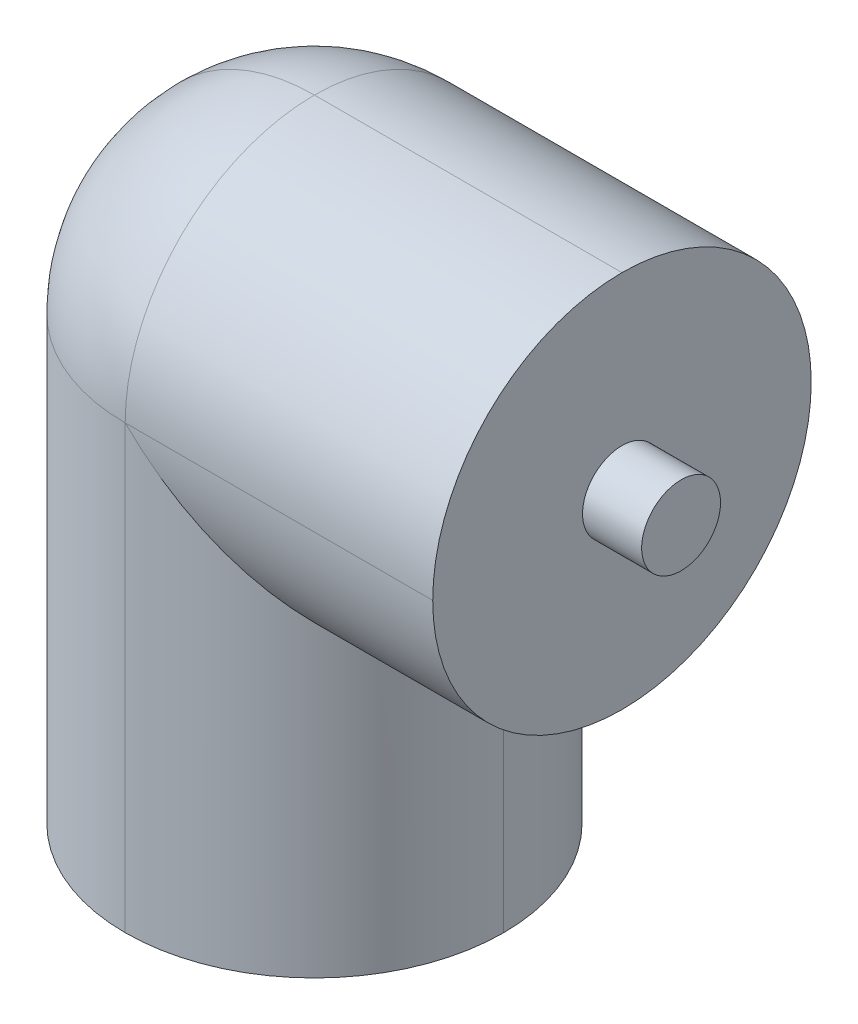
ISO-10303-21;
HEADER;
FILE_DESCRIPTION(('STEP AP214'),'2;1');
FILE_NAME('part.step','',(''),(''),'','','');
FILE_SCHEMA(('AUTOMOTIVE_DESIGN { 1 0 10303 214 1 1 1 1 }'));
ENDSEC;
DATA;
#1=APPLICATION_CONTEXT('core data for automotive mechanical design processes');
#2=APPLICATION_PROTOCOL_DEFINITION('international standard','automotive_design',2000,#1);
#3=PRODUCT_CONTEXT('',#1,'mechanical');
#4=PRODUCT('Part','Part','',(#3));
#5=PRODUCT_RELATED_PRODUCT_CATEGORY('part','',(#4));
#6=PRODUCT_DEFINITION_FORMATION('','',#4);
#7=PRODUCT_DEFINITION_CONTEXT('part definition',#1,'design');
#8=PRODUCT_DEFINITION('design','',#6,#7);
#9=PRODUCT_DEFINITION_SHAPE('','',#8);
#10=(LENGTH_UNIT() NAMED_UNIT(*) SI_UNIT(.MILLI.,.METRE.));
#11=(NAMED_UNIT(*) PLANE_ANGLE_UNIT() SI_UNIT($,.RADIAN.));
#12=(NAMED_UNIT(*) SI_UNIT($,.STERADIAN.) SOLID_ANGLE_UNIT());
#13=UNCERTAINTY_MEASURE_WITH_UNIT(LENGTH_MEASURE(1.E-05),#10,'distance_accuracy_value','');
#14=(GEOMETRIC_REPRESENTATION_CONTEXT(3) GLOBAL_UNCERTAINTY_ASSIGNED_CONTEXT((#13)) GLOBAL_UNIT_ASSIGNED_CONTEXT((#10,
#11,#12)) REPRESENTATION_CONTEXT('',''));
#15=CARTESIAN_POINT('',(0.,0.,0.));
#16=DIRECTION('',(0.,0.,1.));
#17=DIRECTION('',(1.,0.,0.));
#18=AXIS2_PLACEMENT_3D('',#15,#16,#17);
#19=CARTESIAN_POINT('',(0.,0.,0.));
#20=DIRECTION('',(0.,-1.,0.));
#21=DIRECTION('',(0.,0.,-1.));
#22=AXIS2_PLACEMENT_3D('',#19,#20,#21);
#23=PLANE('',#22);
#24=CARTESIAN_POINT('',(24.,0.,-24.));
#25=DIRECTION('',(0.,-1.,0.));
#26=DIRECTION('',(0.,0.,-1.));
#27=AXIS2_PLACEMENT_3D('',#24,#25,#26);
#28=CIRCLE('',#27,5.);
#29=CARTESIAN_POINT('',(24.,0.,-29.));
#30=VERTEX_POINT('',#29);
#31=EDGE_CURVE('E136',#30,#30,#28,.F.);
#32=ORIENTED_EDGE('',*,*,#31,.T.);
#33=EDGE_LOOP('',(#32));
#34=FACE_BOUND('',#33,.T.);
#35=CARTESIAN_POINT('',(24.,0.,-24.));
#36=DIRECTION('',(0.,-1.,0.));
#37=DIRECTION('',(0.,0.,-1.));
#38=AXIS2_PLACEMENT_3D('',#35,#36,#37);
#39=CIRCLE('',#38,24.);
#40=CARTESIAN_POINT('',(0.,0.,-24.));
#41=VERTEX_POINT('',#40);
#42=CARTESIAN_POINT('',(24.,0.,-48.));
#43=VERTEX_POINT('',#42);
#44=EDGE_CURVE('E47',#41,#43,#39,.T.);
#45=ORIENTED_EDGE('',*,*,#44,.T.);
#46=CARTESIAN_POINT('',(24.,0.,-24.));
#47=DIRECTION('',(0.,-1.,0.));
#48=DIRECTION('',(0.,0.,-1.));
#49=AXIS2_PLACEMENT_3D('',#46,#47,#48);
#50=CIRCLE('',#49,24.);
#51=CARTESIAN_POINT('',(48.,0.,-24.));
#52=VERTEX_POINT('',#51);
#53=EDGE_CURVE('E11',#43,#52,#50,.T.);
#54=ORIENTED_EDGE('',*,*,#53,.T.);
#55=CARTESIAN_POINT('',(24.,0.,-24.));
#56=DIRECTION('',(0.,-1.,0.));
#57=DIRECTION('',(0.,0.,-1.));
#58=AXIS2_PLACEMENT_3D('',#55,#56,#57);
#59=CIRCLE('',#58,24.);
#60=CARTESIAN_POINT('',(24.,0.,0.));
#61=VERTEX_POINT('',#60);
#62=EDGE_CURVE('E55',#52,#61,#59,.T.);
#63=ORIENTED_EDGE('',*,*,#62,.T.);
#64=CARTESIAN_POINT('',(24.,0.,-24.));
#65=DIRECTION('',(0.,-1.,0.));
#66=DIRECTION('',(0.,0.,-1.));
#67=AXIS2_PLACEMENT_3D('',#64,#65,#66);
#68=CIRCLE('',#67,24.);
#69=EDGE_CURVE('E102',#61,#41,#68,.T.);
#70=ORIENTED_EDGE('',*,*,#69,.T.);
#71=EDGE_LOOP('',(#45,#54,#63,#70));
#72=FACE_BOUND('',#71,.T.);
#73=ADVANCED_FACE('F37',(#34,#72),#23,.T.);
#74=CARTESIAN_POINT('',(63.,0.,0.));
#75=DIRECTION('',(1.,0.,0.));
#76=DIRECTION('',(0.,0.,-1.));
#77=AXIS2_PLACEMENT_3D('',#74,#75,#76);
#78=PLANE('',#77);
#79=CARTESIAN_POINT('',(63.,56.,-24.));
#80=DIRECTION('',(1.,0.,0.));
#81=DIRECTION('',(0.,0.,-1.));
#82=AXIS2_PLACEMENT_3D('',#79,#80,#81);
#83=CIRCLE('',#82,5.);
#84=CARTESIAN_POINT('',(63.,56.,-29.));
#85=VERTEX_POINT('',#84);
#86=EDGE_CURVE('E41',#85,#85,#83,.F.);
#87=ORIENTED_EDGE('',*,*,#86,.T.);
#88=EDGE_LOOP('',(#87));
#89=FACE_BOUND('',#88,.T.);
#90=CARTESIAN_POINT('',(63.,56.,-24.));
#91=DIRECTION('',(1.,0.,0.));
#92=DIRECTION('',(0.,0.,-1.));
#93=AXIS2_PLACEMENT_3D('',#90,#91,#92);
#94=CIRCLE('',#93,24.);
#95=CARTESIAN_POINT('',(63.,32.,-24.));
#96=VERTEX_POINT('',#95);
#97=CARTESIAN_POINT('',(63.,56.,-48.));
#98=VERTEX_POINT('',#97);
#99=EDGE_CURVE('E135',#96,#98,#94,.T.);
#100=ORIENTED_EDGE('',*,*,#99,.T.);
#101=CARTESIAN_POINT('',(63.,56.,-24.));
#102=DIRECTION('',(1.,0.,0.));
#103=DIRECTION('',(0.,0.,-1.));
#104=AXIS2_PLACEMENT_3D('',#101,#102,#103);
#105=CIRCLE('',#104,24.);
#106=CARTESIAN_POINT('',(63.,80.,-24.));
#107=VERTEX_POINT('',#106);
#108=EDGE_CURVE('E157',#98,#107,#105,.T.);
#109=ORIENTED_EDGE('',*,*,#108,.T.);
#110=CARTESIAN_POINT('',(63.,56.,-24.));
#111=DIRECTION('',(1.,0.,0.));
#112=DIRECTION('',(0.,0.,-1.));
#113=AXIS2_PLACEMENT_3D('',#110,#111,#112);
#114=CIRCLE('',#113,24.);
#115=CARTESIAN_POINT('',(63.,56.,0.));
#116=VERTEX_POINT('',#115);
#117=EDGE_CURVE('E88',#107,#116,#114,.T.);
#118=ORIENTED_EDGE('',*,*,#117,.T.);
#119=CARTESIAN_POINT('',(63.,56.,-24.));
#120=DIRECTION('',(1.,0.,0.));
#121=DIRECTION('',(0.,0.,-1.));
#122=AXIS2_PLACEMENT_3D('',#119,#120,#121);
#123=CIRCLE('',#122,24.);
#124=EDGE_CURVE('E154',#116,#96,#123,.T.);
#125=ORIENTED_EDGE('',*,*,#124,.T.);
#126=EDGE_LOOP('',(#100,#109,#118,#125));
#127=FACE_BOUND('',#126,.T.);
#128=ADVANCED_FACE('F190',(#89,#127),#78,.T.);
#129=CARTESIAN_POINT('',(24.,80.,-24.));
#130=DIRECTION('',(0.,-1.,0.));
#131=DIRECTION('',(0.,0.,-1.));
#132=AXIS2_PLACEMENT_3D('',#129,#130,#131);
#133=CYLINDRICAL_SURFACE('',#132,24.);
#134=DIRECTION('',(0.,-1.,0.));
#135=VECTOR('',#134,1.);
#136=CARTESIAN_POINT('',(24.,80.,0.));
#137=LINE('',#136,#135);
#138=CARTESIAN_POINT('',(24.,56.,0.));
#139=VERTEX_POINT('',#138);
#140=EDGE_CURVE('E74',#61,#139,#137,.F.);
#141=ORIENTED_EDGE('',*,*,#140,.F.);
#142=ORIENTED_EDGE('',*,*,#62,.F.);
#143=DIRECTION('',(0.,-1.,0.));
#144=VECTOR('',#143,1.);
#145=CARTESIAN_POINT('',(48.,80.,-24.));
#146=LINE('',#145,#144);
#147=CARTESIAN_POINT('',(48.,32.,-24.));
#148=VERTEX_POINT('',#147);
#149=EDGE_CURVE('E79',#148,#52,#146,.T.);
#150=ORIENTED_EDGE('',*,*,#149,.F.);
#151=CARTESIAN_POINT('',(24.,56.,-24.));
#152=DIRECTION('',(-0.707106781186547,-0.707106781186547,0.));
#153=DIRECTION('',(-0.707106781186547,0.707106781186547,0.));
#154=AXIS2_PLACEMENT_3D('',#151,#152,#153);
#155=ELLIPSE('',#154,33.9411254969543,24.);
#156=EDGE_CURVE('E132',#139,#148,#155,.F.);
#157=ORIENTED_EDGE('',*,*,#156,.F.);
#158=EDGE_LOOP('',(#141,#142,#150,#157));
#159=FACE_BOUND('',#158,.T.);
#160=ADVANCED_FACE('F39',(#159),#133,.T.);
#161=CARTESIAN_POINT('',(24.,80.,-24.));
#162=DIRECTION('',(0.,-1.,0.));
#163=DIRECTION('',(0.,0.,-1.));
#164=AXIS2_PLACEMENT_3D('',#161,#162,#163);
#165=CYLINDRICAL_SURFACE('',#164,24.);
#166=ORIENTED_EDGE('',*,*,#69,.F.);
#167=ORIENTED_EDGE('',*,*,#140,.T.);
#168=CARTESIAN_POINT('',(24.,56.,-24.));
#169=DIRECTION('',(0.,1.,0.));
#170=DIRECTION('',(0.,0.,1.));
#171=AXIS2_PLACEMENT_3D('',#168,#169,#170);
#172=CIRCLE('',#171,24.);
#173=CARTESIAN_POINT('',(0.,56.,-24.));
#174=VERTEX_POINT('',#173);
#175=EDGE_CURVE('E129',#174,#139,#172,.T.);
#176=ORIENTED_EDGE('',*,*,#175,.F.);
#177=DIRECTION('',(0.,-1.,0.));
#178=VECTOR('',#177,1.);
#179=CARTESIAN_POINT('',(0.,80.,-24.));
#180=LINE('',#179,#178);
#181=EDGE_CURVE('E118',#41,#174,#180,.F.);
#182=ORIENTED_EDGE('',*,*,#181,.F.);
#183=EDGE_LOOP('',(#166,#167,#176,#182));
#184=FACE_BOUND('',#183,.T.);
#185=ADVANCED_FACE('F182',(#184),#165,.T.);
#186=CARTESIAN_POINT('',(24.,80.,-24.));
#187=DIRECTION('',(0.,-1.,0.));
#188=DIRECTION('',(0.,0.,-1.));
#189=AXIS2_PLACEMENT_3D('',#186,#187,#188);
#190=CYLINDRICAL_SURFACE('',#189,24.);
#191=ORIENTED_EDGE('',*,*,#149,.T.);
#192=ORIENTED_EDGE('',*,*,#53,.F.);
#193=DIRECTION('',(0.,-1.,0.));
#194=VECTOR('',#193,1.);
#195=CARTESIAN_POINT('',(24.,80.,-48.));
#196=LINE('',#195,#194);
#197=CARTESIAN_POINT('',(24.,56.,-48.));
#198=VERTEX_POINT('',#197);
#199=EDGE_CURVE('E111',#198,#43,#196,.T.);
#200=ORIENTED_EDGE('',*,*,#199,.F.);
#201=CARTESIAN_POINT('',(24.,56.,-24.));
#202=DIRECTION('',(-0.707106781186547,-0.707106781186547,0.));
#203=DIRECTION('',(-0.707106781186547,0.707106781186547,0.));
#204=AXIS2_PLACEMENT_3D('',#201,#202,#203);
#205=ELLIPSE('',#204,33.9411254969543,24.);
#206=EDGE_CURVE('E119',#148,#198,#205,.F.);
#207=ORIENTED_EDGE('',*,*,#206,.F.);
#208=EDGE_LOOP('',(#191,#192,#200,#207));
#209=FACE_BOUND('',#208,.T.);
#210=ADVANCED_FACE('F109',(#209),#190,.T.);
#211=CARTESIAN_POINT('',(63.,56.,-24.));
#212=DIRECTION('',(-1.,0.,0.));
#213=DIRECTION('',(0.,0.,1.));
#214=AXIS2_PLACEMENT_3D('',#211,#212,#213);
#215=CYLINDRICAL_SURFACE('',#214,24.);
#216=DIRECTION('',(-1.,0.,0.));
#217=VECTOR('',#216,1.);
#218=CARTESIAN_POINT('',(0.,56.,0.));
#219=LINE('',#218,#217);
#220=EDGE_CURVE('E168',#139,#116,#219,.F.);
#221=ORIENTED_EDGE('',*,*,#220,.F.);
#222=ORIENTED_EDGE('',*,*,#156,.T.);
#223=DIRECTION('',(-1.,0.,0.));
#224=VECTOR('',#223,1.);
#225=CARTESIAN_POINT('',(63.,32.,-24.));
#226=LINE('',#225,#224);
#227=EDGE_CURVE('E123',#96,#148,#226,.T.);
#228=ORIENTED_EDGE('',*,*,#227,.F.);
#229=ORIENTED_EDGE('',*,*,#124,.F.);
#230=EDGE_LOOP('',(#221,#222,#228,#229));
#231=FACE_BOUND('',#230,.T.);
#232=ADVANCED_FACE('F178',(#231),#215,.T.);
#233=CARTESIAN_POINT('',(24.,56.,-24.));
#234=DIRECTION('',(-1.,0.,0.));
#235=DIRECTION('',(0.,0.,1.));
#236=AXIS2_PLACEMENT_3D('',#233,#234,#235);
#237=SPHERICAL_SURFACE('',#236,24.);
#238=CARTESIAN_POINT('',(24.,56.,-24.));
#239=DIRECTION('',(0.,0.,1.));
#240=DIRECTION('',(1.,0.,0.));
#241=AXIS2_PLACEMENT_3D('',#238,#239,#240);
#242=CIRCLE('',#241,24.);
#243=CARTESIAN_POINT('',(24.,80.,-24.));
#244=VERTEX_POINT('',#243);
#245=EDGE_CURVE('E121',#174,#244,#242,.F.);
#246=ORIENTED_EDGE('',*,*,#245,.F.);
#247=ORIENTED_EDGE('',*,*,#175,.T.);
#248=CARTESIAN_POINT('',(24.,56.,-24.));
#249=DIRECTION('',(-1.,0.,0.));
#250=DIRECTION('',(0.,0.,1.));
#251=AXIS2_PLACEMENT_3D('',#248,#249,#250);
#252=CIRCLE('',#251,24.);
#253=EDGE_CURVE('E165',#244,#139,#252,.F.);
#254=ORIENTED_EDGE('',*,*,#253,.F.);
#255=EDGE_LOOP('',(#246,#247,#254));
#256=FACE_BOUND('',#255,.T.);
#257=ADVANCED_FACE('F181',(#256),#237,.T.);
#258=CARTESIAN_POINT('',(24.,80.,-24.));
#259=DIRECTION('',(0.,-1.,0.));
#260=DIRECTION('',(0.,0.,-1.));
#261=AXIS2_PLACEMENT_3D('',#258,#259,#260);
#262=CYLINDRICAL_SURFACE('',#261,24.);
#263=ORIENTED_EDGE('',*,*,#44,.F.);
#264=ORIENTED_EDGE('',*,*,#181,.T.);
#265=CARTESIAN_POINT('',(24.,56.,-24.));
#266=DIRECTION('',(0.,1.,0.));
#267=DIRECTION('',(0.,0.,1.));
#268=AXIS2_PLACEMENT_3D('',#265,#266,#267);
#269=CIRCLE('',#268,24.);
#270=EDGE_CURVE('E116',#198,#174,#269,.T.);
#271=ORIENTED_EDGE('',*,*,#270,.F.);
#272=ORIENTED_EDGE('',*,*,#199,.T.);
#273=EDGE_LOOP('',(#263,#264,#271,#272));
#274=FACE_BOUND('',#273,.T.);
#275=ADVANCED_FACE('F114',(#274),#262,.T.);
#276=CARTESIAN_POINT('',(0.,56.,-24.));
#277=DIRECTION('',(-1.,0.,0.));
#278=DIRECTION('',(0.,0.,1.));
#279=AXIS2_PLACEMENT_3D('',#276,#277,#278);
#280=CYLINDRICAL_SURFACE('',#279,24.);
#281=ORIENTED_EDGE('',*,*,#227,.T.);
#282=ORIENTED_EDGE('',*,*,#206,.T.);
#283=DIRECTION('',(-1.,0.,0.));
#284=VECTOR('',#283,1.);
#285=CARTESIAN_POINT('',(0.,56.,-48.));
#286=LINE('',#285,#284);
#287=EDGE_CURVE('E162',#98,#198,#286,.T.);
#288=ORIENTED_EDGE('',*,*,#287,.F.);
#289=ORIENTED_EDGE('',*,*,#99,.F.);
#290=EDGE_LOOP('',(#281,#282,#288,#289));
#291=FACE_BOUND('',#290,.T.);
#292=ADVANCED_FACE('F174',(#291),#280,.T.);
#293=CARTESIAN_POINT('',(0.,56.,-24.));
#294=DIRECTION('',(1.,0.,0.));
#295=DIRECTION('',(0.,0.,-1.));
#296=AXIS2_PLACEMENT_3D('',#293,#294,#295);
#297=CYLINDRICAL_SURFACE('',#296,24.);
#298=ORIENTED_EDGE('',*,*,#220,.T.);
#299=ORIENTED_EDGE('',*,*,#117,.F.);
#300=DIRECTION('',(1.,0.,0.));
#301=VECTOR('',#300,1.);
#302=CARTESIAN_POINT('',(0.,80.,-24.));
#303=LINE('',#302,#301);
#304=EDGE_CURVE('E143',#244,#107,#303,.T.);
#305=ORIENTED_EDGE('',*,*,#304,.F.);
#306=ORIENTED_EDGE('',*,*,#253,.T.);
#307=EDGE_LOOP('',(#298,#299,#305,#306));
#308=FACE_BOUND('',#307,.T.);
#309=ADVANCED_FACE('F209',(#308),#297,.T.);
#310=CARTESIAN_POINT('',(24.,56.,-24.));
#311=DIRECTION('',(-1.,0.,0.));
#312=DIRECTION('',(0.,0.,1.));
#313=AXIS2_PLACEMENT_3D('',#310,#311,#312);
#314=SPHERICAL_SURFACE('',#313,24.);
#315=ORIENTED_EDGE('',*,*,#270,.T.);
#316=ORIENTED_EDGE('',*,*,#245,.T.);
#317=CARTESIAN_POINT('',(24.,56.,-24.));
#318=DIRECTION('',(-1.,0.,0.));
#319=DIRECTION('',(0.,0.,1.));
#320=AXIS2_PLACEMENT_3D('',#317,#318,#319);
#321=CIRCLE('',#320,24.);
#322=EDGE_CURVE('E138',#198,#244,#321,.F.);
#323=ORIENTED_EDGE('',*,*,#322,.F.);
#324=EDGE_LOOP('',(#315,#316,#323));
#325=FACE_BOUND('',#324,.T.);
#326=ADVANCED_FACE('F185',(#325),#314,.T.);
#327=CARTESIAN_POINT('',(0.,56.,-24.));
#328=DIRECTION('',(-1.,0.,0.));
#329=DIRECTION('',(0.,0.,1.));
#330=AXIS2_PLACEMENT_3D('',#327,#328,#329);
#331=CYLINDRICAL_SURFACE('',#330,24.);
#332=ORIENTED_EDGE('',*,*,#108,.F.);
#333=ORIENTED_EDGE('',*,*,#287,.T.);
#334=ORIENTED_EDGE('',*,*,#322,.T.);
#335=ORIENTED_EDGE('',*,*,#304,.T.);
#336=EDGE_LOOP('',(#332,#333,#334,#335));
#337=FACE_BOUND('',#336,.T.);
#338=ADVANCED_FACE('F189',(#337),#331,.T.);
#339=CARTESIAN_POINT('',(24.,-7.5,-24.));
#340=DIRECTION('',(0.,1.,0.));
#341=DIRECTION('',(0.,0.,1.));
#342=AXIS2_PLACEMENT_3D('',#339,#340,#341);
#343=CYLINDRICAL_SURFACE('',#342,5.);
#344=ORIENTED_EDGE('',*,*,#31,.F.);
#345=EDGE_LOOP('',(#344));
#346=FACE_BOUND('',#345,.T.);
#347=CARTESIAN_POINT('',(24.,-7.5,-24.));
#348=DIRECTION('',(0.,-1.,0.));
#349=DIRECTION('',(0.,0.,-1.));
#350=AXIS2_PLACEMENT_3D('',#347,#348,#349);
#351=CIRCLE('',#350,5.);
#352=CARTESIAN_POINT('',(24.,-7.5,-29.));
#353=VERTEX_POINT('',#352);
#354=EDGE_CURVE('E139',#353,#353,#351,.T.);
#355=ORIENTED_EDGE('',*,*,#354,.F.);
#356=EDGE_LOOP('',(#355));
#357=FACE_BOUND('',#356,.T.);
#358=ADVANCED_FACE('F202',(#346,#357),#343,.T.);
#359=CARTESIAN_POINT('',(24.,-7.5,-24.));
#360=DIRECTION('',(0.,-1.,0.));
#361=DIRECTION('',(0.,0.,-1.));
#362=AXIS2_PLACEMENT_3D('',#359,#360,#361);
#363=PLANE('',#362);
#364=ORIENTED_EDGE('',*,*,#354,.T.);
#365=EDGE_LOOP('',(#364));
#366=FACE_BOUND('',#365,.T.);
#367=ADVANCED_FACE('F265',(#366),#363,.T.);
#368=CARTESIAN_POINT('',(70.5,56.,-24.));
#369=DIRECTION('',(-1.,0.,0.));
#370=DIRECTION('',(0.,0.,1.));
#371=AXIS2_PLACEMENT_3D('',#368,#369,#370);
#372=CYLINDRICAL_SURFACE('',#371,5.);
#373=ORIENTED_EDGE('',*,*,#86,.F.);
#374=EDGE_LOOP('',(#373));
#375=FACE_BOUND('',#374,.T.);
#376=CARTESIAN_POINT('',(70.5,56.,-24.));
#377=DIRECTION('',(1.,0.,0.));
#378=DIRECTION('',(0.,0.,-1.));
#379=AXIS2_PLACEMENT_3D('',#376,#377,#378);
#380=CIRCLE('',#379,5.);
#381=CARTESIAN_POINT('',(70.5,56.,-29.));
#382=VERTEX_POINT('',#381);
#383=EDGE_CURVE('E150',#382,#382,#380,.T.);
#384=ORIENTED_EDGE('',*,*,#383,.F.);
#385=EDGE_LOOP('',(#384));
#386=FACE_BOUND('',#385,.T.);
#387=ADVANCED_FACE('F271',(#375,#386),#372,.T.);
#388=CARTESIAN_POINT('',(70.5,56.,-24.));
#389=DIRECTION('',(1.,0.,0.));
#390=DIRECTION('',(0.,0.,-1.));
#391=AXIS2_PLACEMENT_3D('',#388,#389,#390);
#392=PLANE('',#391);
#393=ORIENTED_EDGE('',*,*,#383,.T.);
#394=EDGE_LOOP('',(#393));
#395=FACE_BOUND('',#394,.T.);
#396=ADVANCED_FACE('F276',(#395),#392,.T.);
#397=CLOSED_SHELL('',(#73,#128,#160,#185,#210,#232,#257,#275,#292,#309,#326,#338,#358,#367,#387,#396));
#398=MANIFOLD_SOLID_BREP('B2',#397);
#399=ADVANCED_BREP_SHAPE_REPRESENTATION('',(#18,#398),#14);
#400=SHAPE_DEFINITION_REPRESENTATION(#9,#399);
ENDSEC;
END-ISO-10303-21;
